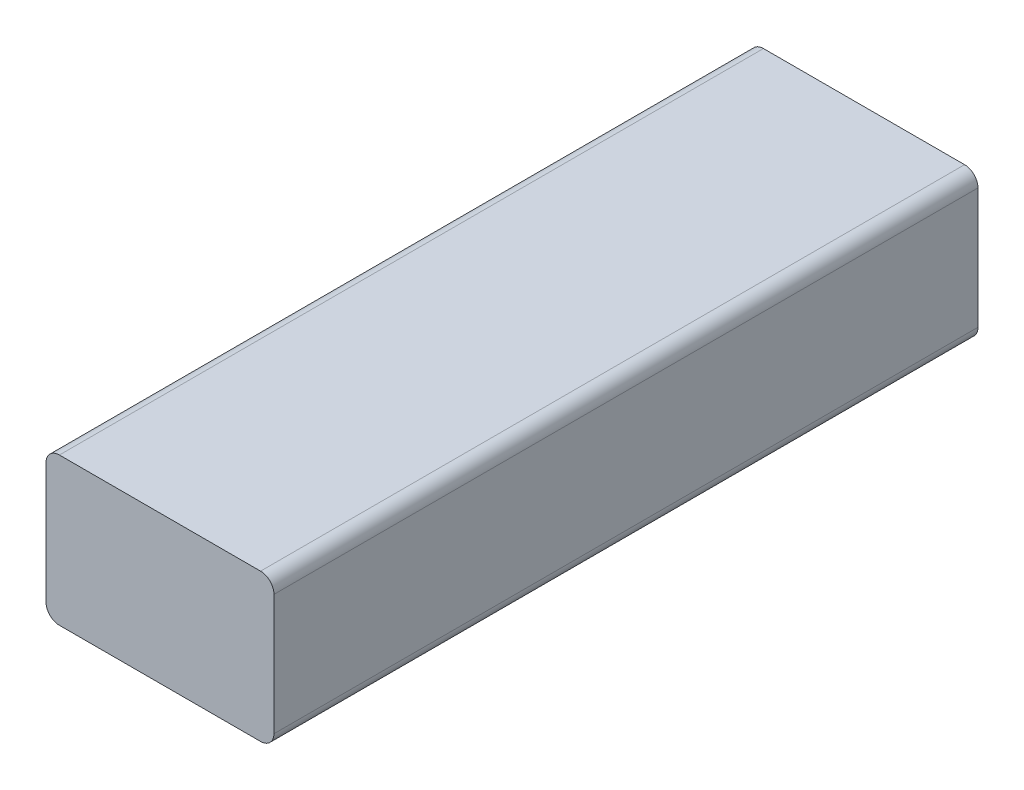
ISO-10303-21;
HEADER;
FILE_DESCRIPTION(('STEP AP214'),'2;1');
FILE_NAME('part.step','',(''),(''),'','','');
FILE_SCHEMA(('AUTOMOTIVE_DESIGN { 1 0 10303 214 1 1 1 1 }'));
ENDSEC;
DATA;
#1=APPLICATION_CONTEXT('core data for automotive mechanical design processes');
#2=APPLICATION_PROTOCOL_DEFINITION('international standard','automotive_design',2000,#1);
#3=PRODUCT_CONTEXT('',#1,'mechanical');
#4=PRODUCT('Part','Part','',(#3));
#5=PRODUCT_RELATED_PRODUCT_CATEGORY('part','',(#4));
#6=PRODUCT_DEFINITION_FORMATION('','',#4);
#7=PRODUCT_DEFINITION_CONTEXT('part definition',#1,'design');
#8=PRODUCT_DEFINITION('design','',#6,#7);
#9=PRODUCT_DEFINITION_SHAPE('','',#8);
#10=(LENGTH_UNIT() NAMED_UNIT(*) SI_UNIT(.MILLI.,.METRE.));
#11=(NAMED_UNIT(*) PLANE_ANGLE_UNIT() SI_UNIT($,.RADIAN.));
#12=(NAMED_UNIT(*) SI_UNIT($,.STERADIAN.) SOLID_ANGLE_UNIT());
#13=UNCERTAINTY_MEASURE_WITH_UNIT(LENGTH_MEASURE(1.E-05),#10,'distance_accuracy_value','');
#14=(GEOMETRIC_REPRESENTATION_CONTEXT(3) GLOBAL_UNCERTAINTY_ASSIGNED_CONTEXT((#13)) GLOBAL_UNIT_ASSIGNED_CONTEXT((#10,
#11,#12)) REPRESENTATION_CONTEXT('',''));
#15=CARTESIAN_POINT('',(0.,0.,0.));
#16=DIRECTION('',(0.,0.,1.));
#17=DIRECTION('',(1.,0.,0.));
#18=AXIS2_PLACEMENT_3D('',#15,#16,#17);
#19=CARTESIAN_POINT('',(2.,20.,105.));
#20=DIRECTION('',(0.,0.,-1.));
#21=DIRECTION('',(-1.,0.,0.));
#22=AXIS2_PLACEMENT_3D('',#19,#20,#21);
#23=CYLINDRICAL_SURFACE('',#22,2.);
#24=CARTESIAN_POINT('',(2.,20.,0.));
#25=DIRECTION('',(0.,0.,1.));
#26=DIRECTION('',(-1.,0.,0.));
#27=AXIS2_PLACEMENT_3D('',#24,#25,#26);
#28=CIRCLE('',#27,2.);
#29=CARTESIAN_POINT('',(2.00000000000001,22.,0.));
#30=VERTEX_POINT('',#29);
#31=CARTESIAN_POINT('',(0.,20.,0.));
#32=VERTEX_POINT('',#31);
#33=EDGE_CURVE('E130',#30,#32,#28,.T.);
#34=ORIENTED_EDGE('',*,*,#33,.T.);
#35=DIRECTION('',(0.,0.,-1.));
#36=VECTOR('',#35,1.);
#37=CARTESIAN_POINT('',(0.,20.,105.));
#38=LINE('',#37,#36);
#39=CARTESIAN_POINT('',(0.,20.,105.));
#40=VERTEX_POINT('',#39);
#41=EDGE_CURVE('E11',#40,#32,#38,.T.);
#42=ORIENTED_EDGE('',*,*,#41,.F.);
#43=CARTESIAN_POINT('',(2.,20.,105.));
#44=DIRECTION('',(0.,0.,1.));
#45=DIRECTION('',(-1.,0.,0.));
#46=AXIS2_PLACEMENT_3D('',#43,#44,#45);
#47=CIRCLE('',#46,2.);
#48=CARTESIAN_POINT('',(2.00000000000001,22.,105.));
#49=VERTEX_POINT('',#48);
#50=EDGE_CURVE('E144',#49,#40,#47,.T.);
#51=ORIENTED_EDGE('',*,*,#50,.F.);
#52=DIRECTION('',(0.,0.,-1.));
#53=VECTOR('',#52,1.);
#54=CARTESIAN_POINT('',(2.00000000000001,22.,105.));
#55=LINE('',#54,#53);
#56=EDGE_CURVE('E126',#49,#30,#55,.T.);
#57=ORIENTED_EDGE('',*,*,#56,.T.);
#58=EDGE_LOOP('',(#34,#42,#51,#57));
#59=FACE_BOUND('',#58,.T.);
#60=ADVANCED_FACE('F34',(#59),#23,.T.);
#61=CARTESIAN_POINT('',(0.,2.00000000000001,105.));
#62=DIRECTION('',(1.,0.,0.));
#63=DIRECTION('',(0.,0.,-1.));
#64=AXIS2_PLACEMENT_3D('',#61,#62,#63);
#65=PLANE('',#64);
#66=DIRECTION('',(0.,-1.,0.));
#67=VECTOR('',#66,1.);
#68=CARTESIAN_POINT('',(0.,2.00000000000001,0.));
#69=LINE('',#68,#67);
#70=CARTESIAN_POINT('',(0.,2.00000000000001,0.));
#71=VERTEX_POINT('',#70);
#72=EDGE_CURVE('E133',#32,#71,#69,.T.);
#73=ORIENTED_EDGE('',*,*,#72,.T.);
#74=DIRECTION('',(0.,0.,-1.));
#75=VECTOR('',#74,1.);
#76=CARTESIAN_POINT('',(0.,2.00000000000001,105.));
#77=LINE('',#76,#75);
#78=CARTESIAN_POINT('',(0.,2.00000000000001,105.));
#79=VERTEX_POINT('',#78);
#80=EDGE_CURVE('E42',#79,#71,#77,.T.);
#81=ORIENTED_EDGE('',*,*,#80,.F.);
#82=DIRECTION('',(0.,-1.,0.));
#83=VECTOR('',#82,1.);
#84=CARTESIAN_POINT('',(0.,2.00000000000001,105.));
#85=LINE('',#84,#83);
#86=EDGE_CURVE('E93',#40,#79,#85,.T.);
#87=ORIENTED_EDGE('',*,*,#86,.F.);
#88=ORIENTED_EDGE('',*,*,#41,.T.);
#89=EDGE_LOOP('',(#73,#81,#87,#88));
#90=FACE_BOUND('',#89,.T.);
#91=ADVANCED_FACE('F179',(#90),#65,.F.);
#92=CARTESIAN_POINT('',(2.,2.,105.));
#93=DIRECTION('',(0.,0.,-1.));
#94=DIRECTION('',(-1.,0.,0.));
#95=AXIS2_PLACEMENT_3D('',#92,#93,#94);
#96=CYLINDRICAL_SURFACE('',#95,2.);
#97=CARTESIAN_POINT('',(2.,2.,0.));
#98=DIRECTION('',(0.,0.,1.));
#99=DIRECTION('',(-1.,0.,0.));
#100=AXIS2_PLACEMENT_3D('',#97,#98,#99);
#101=CIRCLE('',#100,2.);
#102=CARTESIAN_POINT('',(2.00000000000001,0.,0.));
#103=VERTEX_POINT('',#102);
#104=EDGE_CURVE('E135',#71,#103,#101,.T.);
#105=ORIENTED_EDGE('',*,*,#104,.T.);
#106=DIRECTION('',(0.,0.,-1.));
#107=VECTOR('',#106,1.);
#108=CARTESIAN_POINT('',(2.00000000000001,0.,105.));
#109=LINE('',#108,#107);
#110=CARTESIAN_POINT('',(2.00000000000001,0.,105.));
#111=VERTEX_POINT('',#110);
#112=EDGE_CURVE('E151',#111,#103,#109,.T.);
#113=ORIENTED_EDGE('',*,*,#112,.F.);
#114=CARTESIAN_POINT('',(2.,2.,105.));
#115=DIRECTION('',(0.,0.,1.));
#116=DIRECTION('',(-1.,0.,0.));
#117=AXIS2_PLACEMENT_3D('',#114,#115,#116);
#118=CIRCLE('',#117,2.);
#119=EDGE_CURVE('E159',#79,#111,#118,.T.);
#120=ORIENTED_EDGE('',*,*,#119,.F.);
#121=ORIENTED_EDGE('',*,*,#80,.T.);
#122=EDGE_LOOP('',(#105,#113,#120,#121));
#123=FACE_BOUND('',#122,.T.);
#124=ADVANCED_FACE('F157',(#123),#96,.T.);
#125=CARTESIAN_POINT('',(2.00000000000001,0.,105.));
#126=DIRECTION('',(0.,1.,0.));
#127=DIRECTION('',(0.,0.,1.));
#128=AXIS2_PLACEMENT_3D('',#125,#126,#127);
#129=PLANE('',#128);
#130=DIRECTION('',(1.,0.,0.));
#131=VECTOR('',#130,1.);
#132=CARTESIAN_POINT('',(2.00000000000001,0.,0.));
#133=LINE('',#132,#131);
#134=CARTESIAN_POINT('',(32.,0.,0.));
#135=VERTEX_POINT('',#134);
#136=EDGE_CURVE('E137',#103,#135,#133,.T.);
#137=ORIENTED_EDGE('',*,*,#136,.T.);
#138=DIRECTION('',(0.,0.,-1.));
#139=VECTOR('',#138,1.);
#140=CARTESIAN_POINT('',(32.,0.,105.));
#141=LINE('',#140,#139);
#142=CARTESIAN_POINT('',(32.,0.,105.));
#143=VERTEX_POINT('',#142);
#144=EDGE_CURVE('E148',#143,#135,#141,.T.);
#145=ORIENTED_EDGE('',*,*,#144,.F.);
#146=DIRECTION('',(1.,0.,0.));
#147=VECTOR('',#146,1.);
#148=CARTESIAN_POINT('',(2.00000000000001,0.,105.));
#149=LINE('',#148,#147);
#150=EDGE_CURVE('E171',#111,#143,#149,.T.);
#151=ORIENTED_EDGE('',*,*,#150,.F.);
#152=ORIENTED_EDGE('',*,*,#112,.T.);
#153=EDGE_LOOP('',(#137,#145,#151,#152));
#154=FACE_BOUND('',#153,.T.);
#155=ADVANCED_FACE('F167',(#154),#129,.F.);
#156=CARTESIAN_POINT('',(32.,2.,105.));
#157=DIRECTION('',(0.,0.,-1.));
#158=DIRECTION('',(-1.,0.,0.));
#159=AXIS2_PLACEMENT_3D('',#156,#157,#158);
#160=CYLINDRICAL_SURFACE('',#159,2.);
#161=CARTESIAN_POINT('',(32.,2.,0.));
#162=DIRECTION('',(0.,0.,1.));
#163=DIRECTION('',(-1.,0.,0.));
#164=AXIS2_PLACEMENT_3D('',#161,#162,#163);
#165=CIRCLE('',#164,2.);
#166=CARTESIAN_POINT('',(34.,2.00000000000001,0.));
#167=VERTEX_POINT('',#166);
#168=EDGE_CURVE('E139',#135,#167,#165,.T.);
#169=ORIENTED_EDGE('',*,*,#168,.T.);
#170=DIRECTION('',(0.,0.,-1.));
#171=VECTOR('',#170,1.);
#172=CARTESIAN_POINT('',(34.,2.00000000000001,105.));
#173=LINE('',#172,#171);
#174=CARTESIAN_POINT('',(34.,2.00000000000001,105.));
#175=VERTEX_POINT('',#174);
#176=EDGE_CURVE('E121',#175,#167,#173,.T.);
#177=ORIENTED_EDGE('',*,*,#176,.F.);
#178=CARTESIAN_POINT('',(32.,2.,105.));
#179=DIRECTION('',(0.,0.,1.));
#180=DIRECTION('',(-1.,0.,0.));
#181=AXIS2_PLACEMENT_3D('',#178,#179,#180);
#182=CIRCLE('',#181,2.);
#183=EDGE_CURVE('E112',#143,#175,#182,.T.);
#184=ORIENTED_EDGE('',*,*,#183,.F.);
#185=ORIENTED_EDGE('',*,*,#144,.T.);
#186=EDGE_LOOP('',(#169,#177,#184,#185));
#187=FACE_BOUND('',#186,.T.);
#188=ADVANCED_FACE('F170',(#187),#160,.T.);
#189=CARTESIAN_POINT('',(34.,2.00000000000001,105.));
#190=DIRECTION('',(-1.,0.,0.));
#191=DIRECTION('',(0.,0.,1.));
#192=AXIS2_PLACEMENT_3D('',#189,#190,#191);
#193=PLANE('',#192);
#194=DIRECTION('',(0.,1.,0.));
#195=VECTOR('',#194,1.);
#196=CARTESIAN_POINT('',(34.,2.00000000000001,0.));
#197=LINE('',#196,#195);
#198=CARTESIAN_POINT('',(34.,20.,0.));
#199=VERTEX_POINT('',#198);
#200=EDGE_CURVE('E120',#167,#199,#197,.T.);
#201=ORIENTED_EDGE('',*,*,#200,.T.);
#202=DIRECTION('',(0.,0.,-1.));
#203=VECTOR('',#202,1.);
#204=CARTESIAN_POINT('',(34.,20.,105.));
#205=LINE('',#204,#203);
#206=CARTESIAN_POINT('',(34.,20.,105.));
#207=VERTEX_POINT('',#206);
#208=EDGE_CURVE('E117',#207,#199,#205,.T.);
#209=ORIENTED_EDGE('',*,*,#208,.F.);
#210=DIRECTION('',(0.,1.,0.));
#211=VECTOR('',#210,1.);
#212=CARTESIAN_POINT('',(34.,2.00000000000001,105.));
#213=LINE('',#212,#211);
#214=EDGE_CURVE('E106',#175,#207,#213,.T.);
#215=ORIENTED_EDGE('',*,*,#214,.F.);
#216=ORIENTED_EDGE('',*,*,#176,.T.);
#217=EDGE_LOOP('',(#201,#209,#215,#216));
#218=FACE_BOUND('',#217,.T.);
#219=ADVANCED_FACE('F118',(#218),#193,.F.);
#220=CARTESIAN_POINT('',(32.,20.,105.));
#221=DIRECTION('',(0.,0.,-1.));
#222=DIRECTION('',(-1.,0.,0.));
#223=AXIS2_PLACEMENT_3D('',#220,#221,#222);
#224=CYLINDRICAL_SURFACE('',#223,2.);
#225=CARTESIAN_POINT('',(32.,20.,0.));
#226=DIRECTION('',(0.,0.,1.));
#227=DIRECTION('',(1.,0.,0.));
#228=AXIS2_PLACEMENT_3D('',#225,#226,#227);
#229=CIRCLE('',#228,2.);
#230=CARTESIAN_POINT('',(32.,22.,0.));
#231=VERTEX_POINT('',#230);
#232=EDGE_CURVE('E79',#199,#231,#229,.T.);
#233=ORIENTED_EDGE('',*,*,#232,.T.);
#234=DIRECTION('',(0.,0.,-1.));
#235=VECTOR('',#234,1.);
#236=CARTESIAN_POINT('',(32.,22.,105.));
#237=LINE('',#236,#235);
#238=CARTESIAN_POINT('',(32.,22.,105.));
#239=VERTEX_POINT('',#238);
#240=EDGE_CURVE('E122',#239,#231,#237,.T.);
#241=ORIENTED_EDGE('',*,*,#240,.F.);
#242=CARTESIAN_POINT('',(32.,20.,105.));
#243=DIRECTION('',(0.,0.,1.));
#244=DIRECTION('',(1.,0.,0.));
#245=AXIS2_PLACEMENT_3D('',#242,#243,#244);
#246=CIRCLE('',#245,2.);
#247=EDGE_CURVE('E110',#207,#239,#246,.T.);
#248=ORIENTED_EDGE('',*,*,#247,.F.);
#249=ORIENTED_EDGE('',*,*,#208,.T.);
#250=EDGE_LOOP('',(#233,#241,#248,#249));
#251=FACE_BOUND('',#250,.T.);
#252=ADVANCED_FACE('F124',(#251),#224,.T.);
#253=CARTESIAN_POINT('',(2.00000000000001,22.,105.));
#254=DIRECTION('',(0.,-1.,0.));
#255=DIRECTION('',(0.,0.,-1.));
#256=AXIS2_PLACEMENT_3D('',#253,#254,#255);
#257=PLANE('',#256);
#258=DIRECTION('',(-1.,0.,0.));
#259=VECTOR('',#258,1.);
#260=CARTESIAN_POINT('',(2.00000000000001,22.,0.));
#261=LINE('',#260,#259);
#262=EDGE_CURVE('E85',#231,#30,#261,.T.);
#263=ORIENTED_EDGE('',*,*,#262,.T.);
#264=ORIENTED_EDGE('',*,*,#56,.F.);
#265=DIRECTION('',(-1.,0.,0.));
#266=VECTOR('',#265,1.);
#267=CARTESIAN_POINT('',(2.00000000000001,22.,105.));
#268=LINE('',#267,#266);
#269=EDGE_CURVE('E50',#239,#49,#268,.T.);
#270=ORIENTED_EDGE('',*,*,#269,.F.);
#271=ORIENTED_EDGE('',*,*,#240,.T.);
#272=EDGE_LOOP('',(#263,#264,#270,#271));
#273=FACE_BOUND('',#272,.T.);
#274=ADVANCED_FACE('F195',(#273),#257,.F.);
#275=CARTESIAN_POINT('',(2.,20.,105.));
#276=DIRECTION('',(0.,0.,-1.));
#277=DIRECTION('',(-1.,0.,0.));
#278=AXIS2_PLACEMENT_3D('',#275,#276,#277);
#279=PLANE('',#278);
#280=ORIENTED_EDGE('',*,*,#50,.T.);
#281=ORIENTED_EDGE('',*,*,#86,.T.);
#282=ORIENTED_EDGE('',*,*,#119,.T.);
#283=ORIENTED_EDGE('',*,*,#150,.T.);
#284=ORIENTED_EDGE('',*,*,#183,.T.);
#285=ORIENTED_EDGE('',*,*,#214,.T.);
#286=ORIENTED_EDGE('',*,*,#247,.T.);
#287=ORIENTED_EDGE('',*,*,#269,.T.);
#288=EDGE_LOOP('',(#280,#281,#282,#283,#284,#285,#286,#287));
#289=FACE_BOUND('',#288,.T.);
#290=ADVANCED_FACE('F108',(#289),#279,.F.);
#291=CARTESIAN_POINT('',(2.,20.,0.));
#292=DIRECTION('',(0.,0.,-1.));
#293=DIRECTION('',(-1.,0.,0.));
#294=AXIS2_PLACEMENT_3D('',#291,#292,#293);
#295=PLANE('',#294);
#296=ORIENTED_EDGE('',*,*,#33,.F.);
#297=ORIENTED_EDGE('',*,*,#262,.F.);
#298=ORIENTED_EDGE('',*,*,#232,.F.);
#299=ORIENTED_EDGE('',*,*,#200,.F.);
#300=ORIENTED_EDGE('',*,*,#168,.F.);
#301=ORIENTED_EDGE('',*,*,#136,.F.);
#302=ORIENTED_EDGE('',*,*,#104,.F.);
#303=ORIENTED_EDGE('',*,*,#72,.F.);
#304=EDGE_LOOP('',(#296,#297,#298,#299,#300,#301,#302,#303));
#305=FACE_BOUND('',#304,.T.);
#306=ADVANCED_FACE('F163',(#305),#295,.T.);
#307=CLOSED_SHELL('',(#60,#91,#124,#155,#188,#219,#252,#274,#290,#306));
#308=MANIFOLD_SOLID_BREP('B2',#307);
#309=ADVANCED_BREP_SHAPE_REPRESENTATION('',(#18,#308),#14);
#310=SHAPE_DEFINITION_REPRESENTATION(#9,#309);
ENDSEC;
END-ISO-10303-21;
